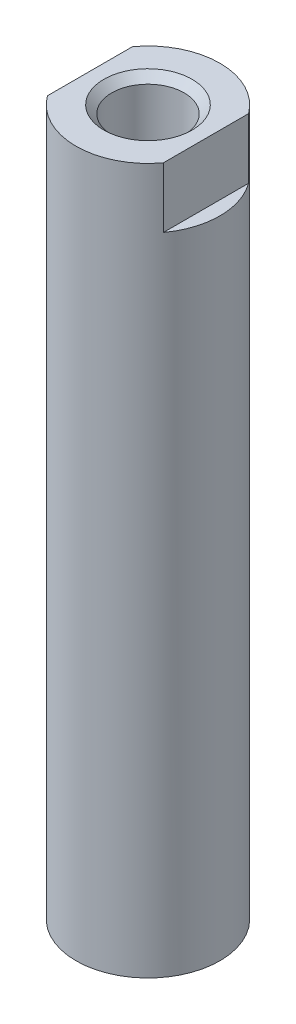
ISO-10303-21;
HEADER;
FILE_DESCRIPTION(('STEP AP214'),'2;1');
FILE_NAME('part.step','',(''),(''),'','','');
FILE_SCHEMA(('AUTOMOTIVE_DESIGN { 1 0 10303 214 1 1 1 1 }'));
ENDSEC;
DATA;
#1=APPLICATION_CONTEXT('core data for automotive mechanical design processes');
#2=APPLICATION_PROTOCOL_DEFINITION('international standard','automotive_design',2000,#1);
#3=PRODUCT_CONTEXT('',#1,'mechanical');
#4=PRODUCT('Part','Part','',(#3));
#5=PRODUCT_RELATED_PRODUCT_CATEGORY('part','',(#4));
#6=PRODUCT_DEFINITION_FORMATION('','',#4);
#7=PRODUCT_DEFINITION_CONTEXT('part definition',#1,'design');
#8=PRODUCT_DEFINITION('design','',#6,#7);
#9=PRODUCT_DEFINITION_SHAPE('','',#8);
#10=(LENGTH_UNIT() NAMED_UNIT(*) SI_UNIT(.MILLI.,.METRE.));
#11=(NAMED_UNIT(*) PLANE_ANGLE_UNIT() SI_UNIT($,.RADIAN.));
#12=(NAMED_UNIT(*) SI_UNIT($,.STERADIAN.) SOLID_ANGLE_UNIT());
#13=UNCERTAINTY_MEASURE_WITH_UNIT(LENGTH_MEASURE(1.E-05),#10,'distance_accuracy_value','');
#14=(GEOMETRIC_REPRESENTATION_CONTEXT(3) GLOBAL_UNCERTAINTY_ASSIGNED_CONTEXT((#13)) GLOBAL_UNIT_ASSIGNED_CONTEXT((#10,
#11,#12)) REPRESENTATION_CONTEXT('',''));
#15=CARTESIAN_POINT('',(0.,0.,0.));
#16=DIRECTION('',(0.,0.,1.));
#17=DIRECTION('',(1.,0.,0.));
#18=AXIS2_PLACEMENT_3D('',#15,#16,#17);
#19=CARTESIAN_POINT('',(0.,38.608,0.));
#20=DIRECTION('',(0.,-1.,0.));
#21=DIRECTION('',(0.,0.,-1.));
#22=AXIS2_PLACEMENT_3D('',#19,#20,#21);
#23=PLANE('',#22);
#24=CARTESIAN_POINT('',(0.,38.608,0.));
#25=DIRECTION('',(0.,1.,0.));
#26=DIRECTION('',(0.,0.,1.));
#27=AXIS2_PLACEMENT_3D('',#24,#25,#26);
#28=CIRCLE('',#27,2.413);
#29=CARTESIAN_POINT('',(0.,38.608,2.413));
#30=VERTEX_POINT('',#29);
#31=EDGE_CURVE('E109',#30,#30,#28,.T.);
#32=ORIENTED_EDGE('',*,*,#31,.F.);
#33=EDGE_LOOP('',(#32));
#34=FACE_BOUND('',#33,.T.);
#35=DIRECTION('',(0.,0.,-1.));
#36=VECTOR('',#35,1.);
#37=CARTESIAN_POINT('',(3.175,38.608,7.874));
#38=LINE('',#37,#36);
#39=CARTESIAN_POINT('',(3.175,38.608,2.32794845303757));
#40=VERTEX_POINT('',#39);
#41=CARTESIAN_POINT('',(3.175,38.608,-2.32794845303757));
#42=VERTEX_POINT('',#41);
#43=EDGE_CURVE('E57',#40,#42,#38,.T.);
#44=ORIENTED_EDGE('',*,*,#43,.T.);
#45=CARTESIAN_POINT('',(0.,38.608,0.));
#46=DIRECTION('',(0.,1.,0.));
#47=DIRECTION('',(0.,0.,1.));
#48=AXIS2_PLACEMENT_3D('',#45,#46,#47);
#49=CIRCLE('',#48,3.937);
#50=CARTESIAN_POINT('',(-3.175,38.608,-2.32794845303757));
#51=VERTEX_POINT('',#50);
#52=EDGE_CURVE('E89',#42,#51,#49,.T.);
#53=ORIENTED_EDGE('',*,*,#52,.T.);
#54=DIRECTION('',(0.,0.,1.));
#55=VECTOR('',#54,1.);
#56=CARTESIAN_POINT('',(-3.175,38.608,-7.874));
#57=LINE('',#56,#55);
#58=CARTESIAN_POINT('',(-3.175,38.608,2.32794845303757));
#59=VERTEX_POINT('',#58);
#60=EDGE_CURVE('E50',#51,#59,#57,.T.);
#61=ORIENTED_EDGE('',*,*,#60,.T.);
#62=EDGE_CURVE('E87',#59,#40,#49,.T.);
#63=ORIENTED_EDGE('',*,*,#62,.T.);
#64=EDGE_LOOP('',(#44,#53,#61,#63));
#65=FACE_BOUND('',#64,.T.);
#66=ADVANCED_FACE('F36',(#34,#65),#23,.F.);
#67=CARTESIAN_POINT('',(0.,0.,0.));
#68=DIRECTION('',(0.,1.,0.));
#69=DIRECTION('',(0.,0.,1.));
#70=AXIS2_PLACEMENT_3D('',#67,#68,#69);
#71=CYLINDRICAL_SURFACE('',#70,3.937);
#72=CARTESIAN_POINT('',(0.,0.,0.));
#73=DIRECTION('',(0.,1.,0.));
#74=DIRECTION('',(0.,0.,1.));
#75=AXIS2_PLACEMENT_3D('',#72,#73,#74);
#76=CIRCLE('',#75,3.937);
#77=CARTESIAN_POINT('',(0.,0.,3.937));
#78=VERTEX_POINT('',#77);
#79=EDGE_CURVE('E94',#78,#78,#76,.T.);
#80=ORIENTED_EDGE('',*,*,#79,.T.);
#81=EDGE_LOOP('',(#80));
#82=FACE_BOUND('',#81,.T.);
#83=DIRECTION('',(0.,1.,0.));
#84=VECTOR('',#83,1.);
#85=CARTESIAN_POINT('',(3.175,0.,-2.32794845303757));
#86=LINE('',#85,#84);
#87=CARTESIAN_POINT('',(3.175,35.306,-2.32794845303757));
#88=VERTEX_POINT('',#87);
#89=EDGE_CURVE('E11',#88,#42,#86,.T.);
#90=ORIENTED_EDGE('',*,*,#89,.F.);
#91=CARTESIAN_POINT('',(0.,35.306,0.));
#92=DIRECTION('',(0.,1.,0.));
#93=DIRECTION('',(0.,0.,1.));
#94=AXIS2_PLACEMENT_3D('',#91,#92,#93);
#95=CIRCLE('',#94,3.937);
#96=CARTESIAN_POINT('',(3.175,35.306,2.32794845303757));
#97=VERTEX_POINT('',#96);
#98=EDGE_CURVE('E43',#97,#88,#95,.T.);
#99=ORIENTED_EDGE('',*,*,#98,.F.);
#100=DIRECTION('',(0.,1.,0.));
#101=VECTOR('',#100,1.);
#102=CARTESIAN_POINT('',(3.175,0.,2.32794845303757));
#103=LINE('',#102,#101);
#104=EDGE_CURVE('E81',#40,#97,#103,.F.);
#105=ORIENTED_EDGE('',*,*,#104,.F.);
#106=ORIENTED_EDGE('',*,*,#62,.F.);
#107=DIRECTION('',(0.,1.,0.));
#108=VECTOR('',#107,1.);
#109=CARTESIAN_POINT('',(-3.175,0.,2.32794845303757));
#110=LINE('',#109,#108);
#111=CARTESIAN_POINT('',(-3.175,35.306,2.32794845303757));
#112=VERTEX_POINT('',#111);
#113=EDGE_CURVE('E74',#112,#59,#110,.T.);
#114=ORIENTED_EDGE('',*,*,#113,.F.);
#115=CARTESIAN_POINT('',(-3.175,35.306,-2.32794845303757));
#116=VERTEX_POINT('',#115);
#117=EDGE_CURVE('E82',#116,#112,#95,.T.);
#118=ORIENTED_EDGE('',*,*,#117,.F.);
#119=DIRECTION('',(0.,1.,0.));
#120=VECTOR('',#119,1.);
#121=CARTESIAN_POINT('',(-3.175,0.,-2.32794845303757));
#122=LINE('',#121,#120);
#123=EDGE_CURVE('E96',#51,#116,#122,.F.);
#124=ORIENTED_EDGE('',*,*,#123,.F.);
#125=ORIENTED_EDGE('',*,*,#52,.F.);
#126=EDGE_LOOP('',(#90,#99,#105,#106,#114,#118,#124,#125));
#127=FACE_BOUND('',#126,.T.);
#128=ADVANCED_FACE('F92',(#82,#127),#71,.T.);
#129=CARTESIAN_POINT('',(3.937,0.,0.));
#130=DIRECTION('',(0.,1.,0.));
#131=DIRECTION('',(0.,0.,1.));
#132=AXIS2_PLACEMENT_3D('',#129,#130,#131);
#133=PLANE('',#132);
#134=ORIENTED_EDGE('',*,*,#79,.F.);
#135=EDGE_LOOP('',(#134));
#136=FACE_BOUND('',#135,.T.);
#137=ADVANCED_FACE('F141',(#136),#133,.F.);
#138=CARTESIAN_POINT('',(0.,26.924,0.));
#139=DIRECTION('',(0.,-1.,0.));
#140=DIRECTION('',(0.,0.,-1.));
#141=AXIS2_PLACEMENT_3D('',#138,#139,#140);
#142=PLANE('',#141);
#143=CARTESIAN_POINT('',(0.,26.924,0.));
#144=DIRECTION('',(0.,1.,0.));
#145=DIRECTION('',(0.,0.,1.));
#146=AXIS2_PLACEMENT_3D('',#143,#144,#145);
#147=CIRCLE('',#146,1.98374);
#148=CARTESIAN_POINT('',(0.,26.924,1.98374));
#149=VERTEX_POINT('',#148);
#150=EDGE_CURVE('E98',#149,#149,#147,.T.);
#151=ORIENTED_EDGE('',*,*,#150,.T.);
#152=EDGE_LOOP('',(#151));
#153=FACE_BOUND('',#152,.T.);
#154=ADVANCED_FACE('F123',(#153),#142,.F.);
#155=CARTESIAN_POINT('',(0.,38.608,0.));
#156=DIRECTION('',(0.,1.,0.));
#157=DIRECTION('',(0.,0.,1.));
#158=AXIS2_PLACEMENT_3D('',#155,#156,#157);
#159=CYLINDRICAL_SURFACE('',#158,1.98374);
#160=ORIENTED_EDGE('',*,*,#150,.F.);
#161=EDGE_LOOP('',(#160));
#162=FACE_BOUND('',#161,.T.);
#163=CARTESIAN_POINT('',(0.,38.17874,0.));
#164=DIRECTION('',(0.,1.,0.));
#165=DIRECTION('',(0.,0.,1.));
#166=AXIS2_PLACEMENT_3D('',#163,#164,#165);
#167=CIRCLE('',#166,1.98374);
#168=CARTESIAN_POINT('',(0.,38.17874,1.98374));
#169=VERTEX_POINT('',#168);
#170=EDGE_CURVE('E118',#169,#169,#167,.T.);
#171=ORIENTED_EDGE('',*,*,#170,.T.);
#172=EDGE_LOOP('',(#171));
#173=FACE_BOUND('',#172,.T.);
#174=ADVANCED_FACE('F125',(#162,#173),#159,.F.);
#175=CARTESIAN_POINT('',(0.,38.608,0.));
#176=DIRECTION('',(0.,1.,0.));
#177=DIRECTION('',(0.,0.,1.));
#178=AXIS2_PLACEMENT_3D('',#175,#176,#177);
#179=CONICAL_SURFACE('',#178,2.413,0.785398163397452);
#180=ORIENTED_EDGE('',*,*,#170,.F.);
#181=EDGE_LOOP('',(#180));
#182=FACE_BOUND('',#181,.T.);
#183=ORIENTED_EDGE('',*,*,#31,.T.);
#184=EDGE_LOOP('',(#183));
#185=FACE_BOUND('',#184,.T.);
#186=ADVANCED_FACE('F128',(#182,#185),#179,.F.);
#187=CARTESIAN_POINT('',(-3.175,35.306,-7.874));
#188=DIRECTION('',(-1.,0.,0.));
#189=DIRECTION('',(0.,0.,1.));
#190=AXIS2_PLACEMENT_3D('',#187,#188,#189);
#191=PLANE('',#190);
#192=ORIENTED_EDGE('',*,*,#113,.T.);
#193=ORIENTED_EDGE('',*,*,#60,.F.);
#194=ORIENTED_EDGE('',*,*,#123,.T.);
#195=DIRECTION('',(0.,0.,1.));
#196=VECTOR('',#195,1.);
#197=CARTESIAN_POINT('',(-3.175,35.306,-7.874));
#198=LINE('',#197,#196);
#199=EDGE_CURVE('E77',#116,#112,#198,.T.);
#200=ORIENTED_EDGE('',*,*,#199,.T.);
#201=EDGE_LOOP('',(#192,#193,#194,#200));
#202=FACE_BOUND('',#201,.T.);
#203=ADVANCED_FACE('F75',(#202),#191,.T.);
#204=CARTESIAN_POINT('',(0.,35.306,0.));
#205=DIRECTION('',(0.,1.,0.));
#206=DIRECTION('',(0.,0.,1.));
#207=AXIS2_PLACEMENT_3D('',#204,#205,#206);
#208=PLANE('',#207);
#209=ORIENTED_EDGE('',*,*,#117,.T.);
#210=ORIENTED_EDGE('',*,*,#199,.F.);
#211=EDGE_LOOP('',(#209,#210));
#212=FACE_BOUND('',#211,.T.);
#213=ADVANCED_FACE('F112',(#212),#208,.T.);
#214=ORIENTED_EDGE('',*,*,#98,.T.);
#215=DIRECTION('',(0.,0.,-1.));
#216=VECTOR('',#215,1.);
#217=CARTESIAN_POINT('',(3.175,35.306,7.874));
#218=LINE('',#217,#216);
#219=EDGE_CURVE('E107',#97,#88,#218,.T.);
#220=ORIENTED_EDGE('',*,*,#219,.F.);
#221=EDGE_LOOP('',(#214,#220));
#222=FACE_BOUND('',#221,.T.);
#223=ADVANCED_FACE('F106',(#222),#208,.T.);
#224=CARTESIAN_POINT('',(3.175,35.306,7.874));
#225=DIRECTION('',(1.,0.,0.));
#226=DIRECTION('',(0.,0.,-1.));
#227=AXIS2_PLACEMENT_3D('',#224,#225,#226);
#228=PLANE('',#227);
#229=ORIENTED_EDGE('',*,*,#89,.T.);
#230=ORIENTED_EDGE('',*,*,#43,.F.);
#231=ORIENTED_EDGE('',*,*,#104,.T.);
#232=ORIENTED_EDGE('',*,*,#219,.T.);
#233=EDGE_LOOP('',(#229,#230,#231,#232));
#234=FACE_BOUND('',#233,.T.);
#235=ADVANCED_FACE('F108',(#234),#228,.T.);
#236=CLOSED_SHELL('',(#66,#128,#137,#154,#174,#186,#203,#213,#223,#235));
#237=MANIFOLD_SOLID_BREP('B2',#236);
#238=ADVANCED_BREP_SHAPE_REPRESENTATION('',(#18,#237),#14);
#239=SHAPE_DEFINITION_REPRESENTATION(#9,#238);
ENDSEC;
END-ISO-10303-21;
